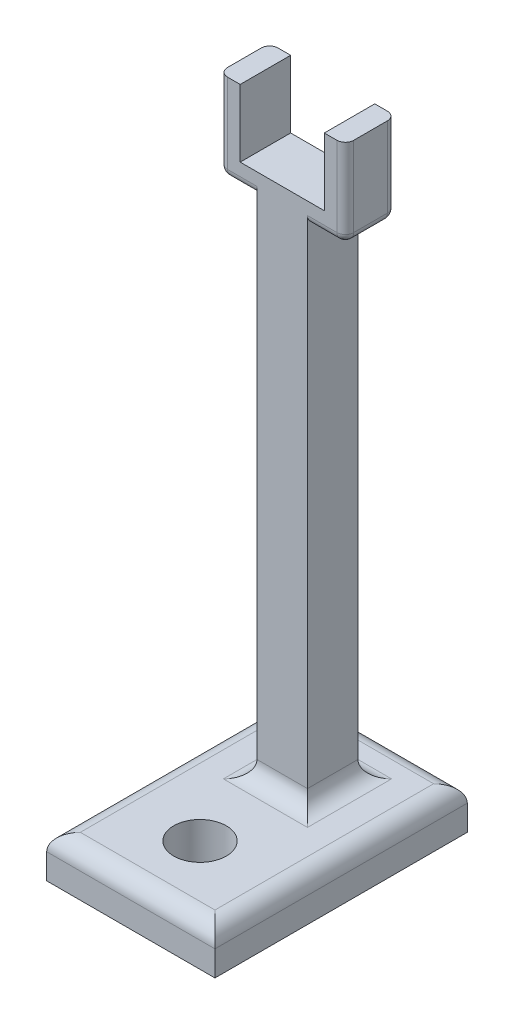
ISO-10303-21;
HEADER;
FILE_DESCRIPTION(('STEP AP214'),'2;1');
FILE_NAME('part.step','',(''),(''),'','','');
FILE_SCHEMA(('AUTOMOTIVE_DESIGN { 1 0 10303 214 1 1 1 1 }'));
ENDSEC;
DATA;
#1=APPLICATION_CONTEXT('core data for automotive mechanical design processes');
#2=APPLICATION_PROTOCOL_DEFINITION('international standard','automotive_design',2000,#1);
#3=PRODUCT_CONTEXT('',#1,'mechanical');
#4=PRODUCT('Part','Part','',(#3));
#5=PRODUCT_RELATED_PRODUCT_CATEGORY('part','',(#4));
#6=PRODUCT_DEFINITION_FORMATION('','',#4);
#7=PRODUCT_DEFINITION_CONTEXT('part definition',#1,'design');
#8=PRODUCT_DEFINITION('design','',#6,#7);
#9=PRODUCT_DEFINITION_SHAPE('','',#8);
#10=(LENGTH_UNIT() NAMED_UNIT(*) SI_UNIT(.MILLI.,.METRE.));
#11=(NAMED_UNIT(*) PLANE_ANGLE_UNIT() SI_UNIT($,.RADIAN.));
#12=(NAMED_UNIT(*) SI_UNIT($,.STERADIAN.) SOLID_ANGLE_UNIT());
#13=UNCERTAINTY_MEASURE_WITH_UNIT(LENGTH_MEASURE(1.E-05),#10,'distance_accuracy_value','');
#14=(GEOMETRIC_REPRESENTATION_CONTEXT(3) GLOBAL_UNCERTAINTY_ASSIGNED_CONTEXT((#13)) GLOBAL_UNIT_ASSIGNED_CONTEXT((#10,
#11,#12)) REPRESENTATION_CONTEXT('',''));
#15=CARTESIAN_POINT('',(0.,0.,0.));
#16=DIRECTION('',(0.,0.,1.));
#17=DIRECTION('',(1.,0.,0.));
#18=AXIS2_PLACEMENT_3D('',#15,#16,#17);
#19=CARTESIAN_POINT('',(0.,6.35,0.));
#20=DIRECTION('',(0.,-1.,0.));
#21=DIRECTION('',(0.,0.,-1.));
#22=AXIS2_PLACEMENT_3D('',#19,#20,#21);
#23=PLANE('',#22);
#24=CARTESIAN_POINT('',(12.7,6.35,-10.4462362128451));
#25=DIRECTION('',(0.,1.,0.));
#26=DIRECTION('',(0.,0.,1.));
#27=AXIS2_PLACEMENT_3D('',#24,#25,#26);
#28=CIRCLE('',#27,3.96875);
#29=CARTESIAN_POINT('',(12.7,6.35,-6.47748621284513));
#30=VERTEX_POINT('',#29);
#31=EDGE_CURVE('E438',#30,#30,#28,.T.);
#32=ORIENTED_EDGE('',*,*,#31,.F.);
#33=EDGE_LOOP('',(#32));
#34=FACE_BOUND('',#33,.T.);
#35=DIRECTION('',(1.,0.,0.));
#36=VECTOR('',#35,1.);
#37=CARTESIAN_POINT('',(8.89,6.35,-20.32));
#38=LINE('',#37,#36);
#39=CARTESIAN_POINT('',(19.05,6.35,-20.32));
#40=VERTEX_POINT('',#39);
#41=CARTESIAN_POINT('',(6.35,6.35,-20.32));
#42=VERTEX_POINT('',#41);
#43=EDGE_CURVE('E374',#40,#42,#38,.F.);
#44=ORIENTED_EDGE('',*,*,#43,.T.);
#45=DIRECTION('',(0.,0.,1.));
#46=VECTOR('',#45,1.);
#47=CARTESIAN_POINT('',(6.35,6.35,-30.48));
#48=LINE('',#47,#46);
#49=CARTESIAN_POINT('',(6.35,6.35,-33.02));
#50=VERTEX_POINT('',#49);
#51=EDGE_CURVE('E380',#42,#50,#48,.F.);
#52=ORIENTED_EDGE('',*,*,#51,.T.);
#53=DIRECTION('',(-1.,0.,0.));
#54=VECTOR('',#53,1.);
#55=CARTESIAN_POINT('',(16.51,6.35,-33.02));
#56=LINE('',#55,#54);
#57=CARTESIAN_POINT('',(19.05,6.35,-33.02));
#58=VERTEX_POINT('',#57);
#59=EDGE_CURVE('E377',#50,#58,#56,.F.);
#60=ORIENTED_EDGE('',*,*,#59,.T.);
#61=DIRECTION('',(0.,0.,-1.));
#62=VECTOR('',#61,1.);
#63=CARTESIAN_POINT('',(19.05,6.35,-22.86));
#64=LINE('',#63,#62);
#65=EDGE_CURVE('E371',#58,#40,#64,.F.);
#66=ORIENTED_EDGE('',*,*,#65,.T.);
#67=EDGE_LOOP('',(#44,#52,#60,#66));
#68=FACE_BOUND('',#67,.T.);
#69=DIRECTION('',(0.,0.,-1.));
#70=VECTOR('',#69,1.);
#71=CARTESIAN_POINT('',(22.86,6.35,0.));
#72=LINE('',#71,#70);
#73=CARTESIAN_POINT('',(22.86,6.35,-2.54));
#74=VERTEX_POINT('',#73);
#75=CARTESIAN_POINT('',(22.86,6.35,-35.56));
#76=VERTEX_POINT('',#75);
#77=EDGE_CURVE('E358',#74,#76,#72,.T.);
#78=ORIENTED_EDGE('',*,*,#77,.T.);
#79=DIRECTION('',(-1.,0.,0.));
#80=VECTOR('',#79,1.);
#81=CARTESIAN_POINT('',(0.,6.35,-35.56));
#82=LINE('',#81,#80);
#83=CARTESIAN_POINT('',(2.54,6.35,-35.56));
#84=VERTEX_POINT('',#83);
#85=EDGE_CURVE('E367',#76,#84,#82,.T.);
#86=ORIENTED_EDGE('',*,*,#85,.T.);
#87=DIRECTION('',(0.,0.,1.));
#88=VECTOR('',#87,1.);
#89=CARTESIAN_POINT('',(2.54,6.35,0.));
#90=LINE('',#89,#88);
#91=CARTESIAN_POINT('',(2.54,6.35,-2.54));
#92=VERTEX_POINT('',#91);
#93=EDGE_CURVE('E364',#84,#92,#90,.T.);
#94=ORIENTED_EDGE('',*,*,#93,.T.);
#95=DIRECTION('',(1.,0.,0.));
#96=VECTOR('',#95,1.);
#97=CARTESIAN_POINT('',(0.,6.35,-2.54));
#98=LINE('',#97,#96);
#99=EDGE_CURVE('E361',#92,#74,#98,.T.);
#100=ORIENTED_EDGE('',*,*,#99,.T.);
#101=EDGE_LOOP('',(#78,#86,#94,#100));
#102=FACE_BOUND('',#101,.T.);
#103=ADVANCED_FACE('F39',(#34,#68,#102),#23,.F.);
#104=CARTESIAN_POINT('',(0.,6.35,0.));
#105=DIRECTION('',(1.,0.,0.));
#106=DIRECTION('',(0.,0.,-1.));
#107=AXIS2_PLACEMENT_3D('',#104,#105,#106);
#108=PLANE('',#107);
#109=DIRECTION('',(0.,-1.,0.));
#110=VECTOR('',#109,1.);
#111=CARTESIAN_POINT('',(0.,6.35,0.));
#112=LINE('',#111,#110);
#113=CARTESIAN_POINT('',(0.,3.81,0.));
#114=VERTEX_POINT('',#113);
#115=CARTESIAN_POINT('',(0.,0.,0.));
#116=VERTEX_POINT('',#115);
#117=EDGE_CURVE('E351',#114,#116,#112,.T.);
#118=ORIENTED_EDGE('',*,*,#117,.F.);
#119=DIRECTION('',(0.,0.,1.));
#120=VECTOR('',#119,1.);
#121=CARTESIAN_POINT('',(0.,3.81,0.));
#122=LINE('',#121,#120);
#123=CARTESIAN_POINT('',(0.,3.81,-38.1));
#124=VERTEX_POINT('',#123);
#125=EDGE_CURVE('E397',#114,#124,#122,.F.);
#126=ORIENTED_EDGE('',*,*,#125,.T.);
#127=DIRECTION('',(0.,-1.,0.));
#128=VECTOR('',#127,1.);
#129=CARTESIAN_POINT('',(0.,6.35,-38.1));
#130=LINE('',#129,#128);
#131=CARTESIAN_POINT('',(0.,0.,-38.1));
#132=VERTEX_POINT('',#131);
#133=EDGE_CURVE('E342',#124,#132,#130,.T.);
#134=ORIENTED_EDGE('',*,*,#133,.T.);
#135=DIRECTION('',(0.,0.,1.));
#136=VECTOR('',#135,1.);
#137=CARTESIAN_POINT('',(0.,0.,0.));
#138=LINE('',#137,#136);
#139=EDGE_CURVE('E326',#132,#116,#138,.T.);
#140=ORIENTED_EDGE('',*,*,#139,.T.);
#141=EDGE_LOOP('',(#118,#126,#134,#140));
#142=FACE_BOUND('',#141,.T.);
#143=ADVANCED_FACE('F662',(#142),#108,.F.);
#144=CARTESIAN_POINT('',(0.,6.35,0.));
#145=DIRECTION('',(0.,0.,-1.));
#146=DIRECTION('',(-1.,0.,0.));
#147=AXIS2_PLACEMENT_3D('',#144,#145,#146);
#148=PLANE('',#147);
#149=DIRECTION('',(0.,-1.,0.));
#150=VECTOR('',#149,1.);
#151=CARTESIAN_POINT('',(25.4,6.35,0.));
#152=LINE('',#151,#150);
#153=CARTESIAN_POINT('',(25.4,3.81,0.));
#154=VERTEX_POINT('',#153);
#155=CARTESIAN_POINT('',(25.4,0.,0.));
#156=VERTEX_POINT('',#155);
#157=EDGE_CURVE('E348',#154,#156,#152,.T.);
#158=ORIENTED_EDGE('',*,*,#157,.F.);
#159=DIRECTION('',(1.,0.,0.));
#160=VECTOR('',#159,1.);
#161=CARTESIAN_POINT('',(0.,3.81,0.));
#162=LINE('',#161,#160);
#163=EDGE_CURVE('E400',#154,#114,#162,.F.);
#164=ORIENTED_EDGE('',*,*,#163,.T.);
#165=ORIENTED_EDGE('',*,*,#117,.T.);
#166=DIRECTION('',(1.,0.,0.));
#167=VECTOR('',#166,1.);
#168=CARTESIAN_POINT('',(0.,0.,0.));
#169=LINE('',#168,#167);
#170=EDGE_CURVE('E330',#116,#156,#169,.T.);
#171=ORIENTED_EDGE('',*,*,#170,.T.);
#172=EDGE_LOOP('',(#158,#164,#165,#171));
#173=FACE_BOUND('',#172,.T.);
#174=ADVANCED_FACE('F668',(#173),#148,.F.);
#175=CARTESIAN_POINT('',(25.4,6.35,0.));
#176=DIRECTION('',(-1.,0.,0.));
#177=DIRECTION('',(0.,0.,1.));
#178=AXIS2_PLACEMENT_3D('',#175,#176,#177);
#179=PLANE('',#178);
#180=DIRECTION('',(0.,-1.,0.));
#181=VECTOR('',#180,1.);
#182=CARTESIAN_POINT('',(25.4,6.35,-38.1));
#183=LINE('',#182,#181);
#184=CARTESIAN_POINT('',(25.4,3.81,-38.1));
#185=VERTEX_POINT('',#184);
#186=CARTESIAN_POINT('',(25.4,0.,-38.1));
#187=VERTEX_POINT('',#186);
#188=EDGE_CURVE('E345',#185,#187,#183,.T.);
#189=ORIENTED_EDGE('',*,*,#188,.F.);
#190=DIRECTION('',(0.,0.,-1.));
#191=VECTOR('',#190,1.);
#192=CARTESIAN_POINT('',(25.4,3.81,0.));
#193=LINE('',#192,#191);
#194=EDGE_CURVE('E403',#185,#154,#193,.F.);
#195=ORIENTED_EDGE('',*,*,#194,.T.);
#196=ORIENTED_EDGE('',*,*,#157,.T.);
#197=DIRECTION('',(0.,0.,-1.));
#198=VECTOR('',#197,1.);
#199=CARTESIAN_POINT('',(25.4,0.,0.));
#200=LINE('',#199,#198);
#201=EDGE_CURVE('E334',#156,#187,#200,.T.);
#202=ORIENTED_EDGE('',*,*,#201,.T.);
#203=EDGE_LOOP('',(#189,#195,#196,#202));
#204=FACE_BOUND('',#203,.T.);
#205=ADVANCED_FACE('F683',(#204),#179,.F.);
#206=CARTESIAN_POINT('',(0.,6.35,-38.1));
#207=DIRECTION('',(0.,0.,1.));
#208=DIRECTION('',(1.,0.,0.));
#209=AXIS2_PLACEMENT_3D('',#206,#207,#208);
#210=PLANE('',#209);
#211=ORIENTED_EDGE('',*,*,#133,.F.);
#212=DIRECTION('',(-1.,0.,0.));
#213=VECTOR('',#212,1.);
#214=CARTESIAN_POINT('',(0.,3.81,-38.1));
#215=LINE('',#214,#213);
#216=EDGE_CURVE('E393',#124,#185,#215,.F.);
#217=ORIENTED_EDGE('',*,*,#216,.T.);
#218=ORIENTED_EDGE('',*,*,#188,.T.);
#219=DIRECTION('',(-1.,0.,0.));
#220=VECTOR('',#219,1.);
#221=CARTESIAN_POINT('',(0.,0.,-38.1));
#222=LINE('',#221,#220);
#223=EDGE_CURVE('E338',#187,#132,#222,.T.);
#224=ORIENTED_EDGE('',*,*,#223,.T.);
#225=EDGE_LOOP('',(#211,#217,#218,#224));
#226=FACE_BOUND('',#225,.T.);
#227=ADVANCED_FACE('F679',(#226),#210,.F.);
#228=CARTESIAN_POINT('',(0.,0.,0.));
#229=DIRECTION('',(0.,-1.,0.));
#230=DIRECTION('',(0.,0.,-1.));
#231=AXIS2_PLACEMENT_3D('',#228,#229,#230);
#232=PLANE('',#231);
#233=CARTESIAN_POINT('',(12.7,0.,-10.4462362128451));
#234=DIRECTION('',(0.,-1.,0.));
#235=DIRECTION('',(0.,0.,-1.));
#236=AXIS2_PLACEMENT_3D('',#233,#234,#235);
#237=CIRCLE('',#236,3.96875);
#238=CARTESIAN_POINT('',(12.7,0.,-14.4149862128451));
#239=VERTEX_POINT('',#238);
#240=EDGE_CURVE('E425',#239,#239,#237,.T.);
#241=ORIENTED_EDGE('',*,*,#240,.F.);
#242=EDGE_LOOP('',(#241));
#243=FACE_BOUND('',#242,.T.);
#244=ORIENTED_EDGE('',*,*,#139,.F.);
#245=ORIENTED_EDGE('',*,*,#223,.F.);
#246=ORIENTED_EDGE('',*,*,#201,.F.);
#247=ORIENTED_EDGE('',*,*,#170,.F.);
#248=EDGE_LOOP('',(#244,#245,#246,#247));
#249=FACE_BOUND('',#248,.T.);
#250=ADVANCED_FACE('F676',(#243,#249),#232,.T.);
#251=CARTESIAN_POINT('',(8.89,82.55,-22.86));
#252=DIRECTION('',(1.,0.,0.));
#253=DIRECTION('',(0.,0.,-1.));
#254=AXIS2_PLACEMENT_3D('',#251,#252,#253);
#255=PLANE('',#254);
#256=DIRECTION('',(0.,-1.,0.));
#257=VECTOR('',#256,1.);
#258=CARTESIAN_POINT('',(8.89,82.55,-30.48));
#259=LINE('',#258,#257);
#260=CARTESIAN_POINT('',(8.89,83.82,-30.48));
#261=VERTEX_POINT('',#260);
#262=CARTESIAN_POINT('',(8.89,8.89000000000002,-30.48));
#263=VERTEX_POINT('',#262);
#264=EDGE_CURVE('E310',#261,#263,#259,.T.);
#265=ORIENTED_EDGE('',*,*,#264,.T.);
#266=DIRECTION('',(0.,0.,1.));
#267=VECTOR('',#266,1.);
#268=CARTESIAN_POINT('',(8.89,8.89,-22.86));
#269=LINE('',#268,#267);
#270=CARTESIAN_POINT('',(8.89,8.89000000000002,-22.86));
#271=VERTEX_POINT('',#270);
#272=EDGE_CURVE('E354',#263,#271,#269,.T.);
#273=ORIENTED_EDGE('',*,*,#272,.T.);
#274=DIRECTION('',(0.,-1.,0.));
#275=VECTOR('',#274,1.);
#276=CARTESIAN_POINT('',(8.89,82.55,-22.86));
#277=LINE('',#276,#275);
#278=CARTESIAN_POINT('',(8.89,83.82,-22.86));
#279=VERTEX_POINT('',#278);
#280=EDGE_CURVE('E322',#279,#271,#277,.T.);
#281=ORIENTED_EDGE('',*,*,#280,.F.);
#282=CARTESIAN_POINT('',(8.89,83.82,-24.13));
#283=DIRECTION('',(1.,0.,0.));
#284=DIRECTION('',(0.,0.,-1.));
#285=AXIS2_PLACEMENT_3D('',#282,#283,#284);
#286=CIRCLE('',#285,1.27);
#287=CARTESIAN_POINT('',(8.89,82.55,-24.13));
#288=VERTEX_POINT('',#287);
#289=EDGE_CURVE('E49',#279,#288,#286,.T.);
#290=ORIENTED_EDGE('',*,*,#289,.T.);
#291=DIRECTION('',(0.,0.,1.));
#292=VECTOR('',#291,1.);
#293=CARTESIAN_POINT('',(8.89,82.55,-22.86));
#294=LINE('',#293,#292);
#295=CARTESIAN_POINT('',(8.89,82.55,-29.21));
#296=VERTEX_POINT('',#295);
#297=EDGE_CURVE('E292',#296,#288,#294,.T.);
#298=ORIENTED_EDGE('',*,*,#297,.F.);
#299=CARTESIAN_POINT('',(8.89,83.82,-29.21));
#300=DIRECTION('',(1.,0.,0.));
#301=DIRECTION('',(0.,0.,-1.));
#302=AXIS2_PLACEMENT_3D('',#299,#300,#301);
#303=CIRCLE('',#302,1.27);
#304=EDGE_CURVE('E511',#296,#261,#303,.T.);
#305=ORIENTED_EDGE('',*,*,#304,.T.);
#306=EDGE_LOOP('',(#265,#273,#281,#290,#298,#305));
#307=FACE_BOUND('',#306,.T.);
#308=ADVANCED_FACE('F603',(#307),#255,.F.);
#309=CARTESIAN_POINT('',(8.89,82.55,-22.86));
#310=DIRECTION('',(0.,0.,-1.));
#311=DIRECTION('',(-1.,0.,0.));
#312=AXIS2_PLACEMENT_3D('',#309,#310,#311);
#313=PLANE('',#312);
#314=DIRECTION('',(1.,0.,0.));
#315=VECTOR('',#314,1.);
#316=CARTESIAN_POINT('',(8.89,83.82,-22.86));
#317=LINE('',#316,#315);
#318=CARTESIAN_POINT('',(4.44499999999999,83.82,-22.86));
#319=VERTEX_POINT('',#318);
#320=EDGE_CURVE('E495',#319,#279,#317,.T.);
#321=ORIENTED_EDGE('',*,*,#320,.T.);
#322=ORIENTED_EDGE('',*,*,#280,.T.);
#323=DIRECTION('',(1.,0.,0.));
#324=VECTOR('',#323,1.);
#325=CARTESIAN_POINT('',(16.51,8.89,-22.86));
#326=LINE('',#325,#324);
#327=CARTESIAN_POINT('',(16.51,8.89000000000002,-22.86));
#328=VERTEX_POINT('',#327);
#329=EDGE_CURVE('E387',#271,#328,#326,.T.);
#330=ORIENTED_EDGE('',*,*,#329,.T.);
#331=DIRECTION('',(0.,-1.,0.));
#332=VECTOR('',#331,1.);
#333=CARTESIAN_POINT('',(16.51,82.55,-22.86));
#334=LINE('',#333,#332);
#335=CARTESIAN_POINT('',(16.51,83.82,-22.86));
#336=VERTEX_POINT('',#335);
#337=EDGE_CURVE('E318',#336,#328,#334,.T.);
#338=ORIENTED_EDGE('',*,*,#337,.F.);
#339=DIRECTION('',(1.,0.,0.));
#340=VECTOR('',#339,1.);
#341=CARTESIAN_POINT('',(22.225,83.82,-22.86));
#342=LINE('',#341,#340);
#343=CARTESIAN_POINT('',(20.955,83.82,-22.86));
#344=VERTEX_POINT('',#343);
#345=EDGE_CURVE('E489',#336,#344,#342,.T.);
#346=ORIENTED_EDGE('',*,*,#345,.T.);
#347=DIRECTION('',(0.,1.,0.));
#348=VECTOR('',#347,1.);
#349=CARTESIAN_POINT('',(20.955,95.885,-22.86));
#350=LINE('',#349,#348);
#351=CARTESIAN_POINT('',(20.955,95.885,-22.86));
#352=VERTEX_POINT('',#351);
#353=EDGE_CURVE('E486',#344,#352,#350,.T.);
#354=ORIENTED_EDGE('',*,*,#353,.T.);
#355=DIRECTION('',(-1.,0.,0.));
#356=VECTOR('',#355,1.);
#357=CARTESIAN_POINT('',(19.05,95.885,-22.86));
#358=LINE('',#357,#356);
#359=CARTESIAN_POINT('',(19.05,95.885,-22.86));
#360=VERTEX_POINT('',#359);
#361=EDGE_CURVE('E271',#352,#360,#358,.T.);
#362=ORIENTED_EDGE('',*,*,#361,.T.);
#363=DIRECTION('',(0.,-1.,0.));
#364=VECTOR('',#363,1.);
#365=CARTESIAN_POINT('',(19.05,95.885,-22.86));
#366=LINE('',#365,#364);
#367=CARTESIAN_POINT('',(19.05,85.725,-22.86));
#368=VERTEX_POINT('',#367);
#369=EDGE_CURVE('E247',#360,#368,#366,.T.);
#370=ORIENTED_EDGE('',*,*,#369,.T.);
#371=DIRECTION('',(-1.,0.,0.));
#372=VECTOR('',#371,1.);
#373=CARTESIAN_POINT('',(6.34999999999999,85.725,-22.86));
#374=LINE('',#373,#372);
#375=CARTESIAN_POINT('',(6.34999999999999,85.725,-22.86));
#376=VERTEX_POINT('',#375);
#377=EDGE_CURVE('E277',#368,#376,#374,.T.);
#378=ORIENTED_EDGE('',*,*,#377,.T.);
#379=DIRECTION('',(0.,1.,0.));
#380=VECTOR('',#379,1.);
#381=CARTESIAN_POINT('',(6.34999999999999,95.885,-22.86));
#382=LINE('',#381,#380);
#383=CARTESIAN_POINT('',(6.34999999999999,95.885,-22.86));
#384=VERTEX_POINT('',#383);
#385=EDGE_CURVE('E281',#376,#384,#382,.T.);
#386=ORIENTED_EDGE('',*,*,#385,.T.);
#387=DIRECTION('',(-1.,0.,0.));
#388=VECTOR('',#387,1.);
#389=CARTESIAN_POINT('',(3.17499999999999,95.885,-22.86));
#390=LINE('',#389,#388);
#391=CARTESIAN_POINT('',(4.44499999999999,95.885,-22.86));
#392=VERTEX_POINT('',#391);
#393=EDGE_CURVE('E241',#384,#392,#390,.T.);
#394=ORIENTED_EDGE('',*,*,#393,.T.);
#395=DIRECTION('',(0.,-1.,0.));
#396=VECTOR('',#395,1.);
#397=CARTESIAN_POINT('',(4.44499999999999,82.55,-22.86));
#398=LINE('',#397,#396);
#399=EDGE_CURVE('E492',#392,#319,#398,.T.);
#400=ORIENTED_EDGE('',*,*,#399,.T.);
#401=EDGE_LOOP('',(#321,#322,#330,#338,#346,#354,#362,#370,#378,#386,#394,#400));
#402=FACE_BOUND('',#401,.T.);
#403=ADVANCED_FACE('F605',(#402),#313,.F.);
#404=CARTESIAN_POINT('',(16.51,82.55,-22.86));
#405=DIRECTION('',(-1.,0.,0.));
#406=DIRECTION('',(0.,0.,1.));
#407=AXIS2_PLACEMENT_3D('',#404,#405,#406);
#408=PLANE('',#407);
#409=ORIENTED_EDGE('',*,*,#337,.T.);
#410=DIRECTION('',(0.,0.,-1.));
#411=VECTOR('',#410,1.);
#412=CARTESIAN_POINT('',(16.51,8.89,-30.48));
#413=LINE('',#412,#411);
#414=CARTESIAN_POINT('',(16.51,8.89000000000002,-30.48));
#415=VERTEX_POINT('',#414);
#416=EDGE_CURVE('E390',#328,#415,#413,.T.);
#417=ORIENTED_EDGE('',*,*,#416,.T.);
#418=DIRECTION('',(0.,-1.,0.));
#419=VECTOR('',#418,1.);
#420=CARTESIAN_POINT('',(16.51,82.55,-30.48));
#421=LINE('',#420,#419);
#422=CARTESIAN_POINT('',(16.51,83.82,-30.48));
#423=VERTEX_POINT('',#422);
#424=EDGE_CURVE('E314',#423,#415,#421,.T.);
#425=ORIENTED_EDGE('',*,*,#424,.F.);
#426=CARTESIAN_POINT('',(16.51,83.82,-29.21));
#427=DIRECTION('',(-1.,0.,0.));
#428=DIRECTION('',(0.,0.,1.));
#429=AXIS2_PLACEMENT_3D('',#426,#427,#428);
#430=CIRCLE('',#429,1.27);
#431=CARTESIAN_POINT('',(16.51,82.55,-29.21));
#432=VERTEX_POINT('',#431);
#433=EDGE_CURVE('E515',#423,#432,#430,.T.);
#434=ORIENTED_EDGE('',*,*,#433,.T.);
#435=DIRECTION('',(0.,0.,-1.));
#436=VECTOR('',#435,1.);
#437=CARTESIAN_POINT('',(16.51,82.55,-22.86));
#438=LINE('',#437,#436);
#439=CARTESIAN_POINT('',(16.51,82.55,-24.13));
#440=VERTEX_POINT('',#439);
#441=EDGE_CURVE('E306',#440,#432,#438,.T.);
#442=ORIENTED_EDGE('',*,*,#441,.F.);
#443=CARTESIAN_POINT('',(16.51,83.82,-24.13));
#444=DIRECTION('',(-1.,0.,0.));
#445=DIRECTION('',(0.,0.,1.));
#446=AXIS2_PLACEMENT_3D('',#443,#444,#445);
#447=CIRCLE('',#446,1.27);
#448=EDGE_CURVE('E11',#440,#336,#447,.T.);
#449=ORIENTED_EDGE('',*,*,#448,.T.);
#450=EDGE_LOOP('',(#409,#417,#425,#434,#442,#449));
#451=FACE_BOUND('',#450,.T.);
#452=ADVANCED_FACE('F941',(#451),#408,.F.);
#453=CARTESIAN_POINT('',(8.89,82.55,-30.48));
#454=DIRECTION('',(0.,0.,1.));
#455=DIRECTION('',(1.,0.,0.));
#456=AXIS2_PLACEMENT_3D('',#453,#454,#455);
#457=PLANE('',#456);
#458=DIRECTION('',(1.,0.,0.));
#459=VECTOR('',#458,1.);
#460=CARTESIAN_POINT('',(3.17499999999999,83.82,-30.48));
#461=LINE('',#460,#459);
#462=CARTESIAN_POINT('',(4.44499999999999,83.82,-30.48));
#463=VERTEX_POINT('',#462);
#464=EDGE_CURVE('E464',#261,#463,#461,.F.);
#465=ORIENTED_EDGE('',*,*,#464,.T.);
#466=DIRECTION('',(0.,-1.,0.));
#467=VECTOR('',#466,1.);
#468=CARTESIAN_POINT('',(4.44499999999999,95.885,-30.48));
#469=LINE('',#468,#467);
#470=CARTESIAN_POINT('',(4.44499999999999,95.885,-30.48));
#471=VERTEX_POINT('',#470);
#472=EDGE_CURVE('E467',#463,#471,#469,.F.);
#473=ORIENTED_EDGE('',*,*,#472,.T.);
#474=DIRECTION('',(-1.,0.,0.));
#475=VECTOR('',#474,1.);
#476=CARTESIAN_POINT('',(3.17499999999999,95.885,-30.48));
#477=LINE('',#476,#475);
#478=CARTESIAN_POINT('',(6.34999999999999,95.885,-30.48));
#479=VERTEX_POINT('',#478);
#480=EDGE_CURVE('E267',#479,#471,#477,.T.);
#481=ORIENTED_EDGE('',*,*,#480,.F.);
#482=DIRECTION('',(0.,1.,0.));
#483=VECTOR('',#482,1.);
#484=CARTESIAN_POINT('',(6.34999999999999,95.885,-30.48));
#485=LINE('',#484,#483);
#486=CARTESIAN_POINT('',(6.34999999999999,85.725,-30.48));
#487=VERTEX_POINT('',#486);
#488=EDGE_CURVE('E260',#487,#479,#485,.T.);
#489=ORIENTED_EDGE('',*,*,#488,.F.);
#490=DIRECTION('',(-1.,0.,0.));
#491=VECTOR('',#490,1.);
#492=CARTESIAN_POINT('',(6.34999999999999,85.725,-30.48));
#493=LINE('',#492,#491);
#494=CARTESIAN_POINT('',(19.05,85.725,-30.48));
#495=VERTEX_POINT('',#494);
#496=EDGE_CURVE('E256',#495,#487,#493,.T.);
#497=ORIENTED_EDGE('',*,*,#496,.F.);
#498=DIRECTION('',(0.,-1.,0.));
#499=VECTOR('',#498,1.);
#500=CARTESIAN_POINT('',(19.05,95.885,-30.48));
#501=LINE('',#500,#499);
#502=CARTESIAN_POINT('',(19.05,95.885,-30.48));
#503=VERTEX_POINT('',#502);
#504=EDGE_CURVE('E240',#503,#495,#501,.T.);
#505=ORIENTED_EDGE('',*,*,#504,.F.);
#506=DIRECTION('',(-1.,0.,0.));
#507=VECTOR('',#506,1.);
#508=CARTESIAN_POINT('',(19.05,95.885,-30.48));
#509=LINE('',#508,#507);
#510=CARTESIAN_POINT('',(20.955,95.885,-30.48));
#511=VERTEX_POINT('',#510);
#512=EDGE_CURVE('E227',#511,#503,#509,.T.);
#513=ORIENTED_EDGE('',*,*,#512,.F.);
#514=DIRECTION('',(0.,1.,0.));
#515=VECTOR('',#514,1.);
#516=CARTESIAN_POINT('',(20.955,82.55,-30.48));
#517=LINE('',#516,#515);
#518=CARTESIAN_POINT('',(20.955,83.82,-30.48));
#519=VERTEX_POINT('',#518);
#520=EDGE_CURVE('E457',#511,#519,#517,.F.);
#521=ORIENTED_EDGE('',*,*,#520,.T.);
#522=DIRECTION('',(1.,0.,0.));
#523=VECTOR('',#522,1.);
#524=CARTESIAN_POINT('',(16.51,83.82,-30.48));
#525=LINE('',#524,#523);
#526=EDGE_CURVE('E460',#519,#423,#525,.F.);
#527=ORIENTED_EDGE('',*,*,#526,.T.);
#528=ORIENTED_EDGE('',*,*,#424,.T.);
#529=DIRECTION('',(-1.,0.,0.));
#530=VECTOR('',#529,1.);
#531=CARTESIAN_POINT('',(8.89,8.89,-30.48));
#532=LINE('',#531,#530);
#533=EDGE_CURVE('E384',#415,#263,#532,.T.);
#534=ORIENTED_EDGE('',*,*,#533,.T.);
#535=ORIENTED_EDGE('',*,*,#264,.F.);
#536=EDGE_LOOP('',(#465,#473,#481,#489,#497,#505,#513,#521,#527,#528,#534,#535));
#537=FACE_BOUND('',#536,.T.);
#538=ADVANCED_FACE('F253',(#537),#457,.F.);
#539=CARTESIAN_POINT('',(3.17499999999999,82.55,-30.48));
#540=DIRECTION('',(0.,-1.,0.));
#541=DIRECTION('',(0.,0.,-1.));
#542=AXIS2_PLACEMENT_3D('',#539,#540,#541);
#543=PLANE('',#542);
#544=DIRECTION('',(0.,0.,1.));
#545=VECTOR('',#544,1.);
#546=CARTESIAN_POINT('',(4.44499999999999,82.55,-30.48));
#547=LINE('',#546,#545);
#548=CARTESIAN_POINT('',(4.44499999999999,82.55,-24.13));
#549=VERTEX_POINT('',#548);
#550=CARTESIAN_POINT('',(4.44499999999999,82.55,-29.21));
#551=VERTEX_POINT('',#550);
#552=EDGE_CURVE('E451',#549,#551,#547,.F.);
#553=ORIENTED_EDGE('',*,*,#552,.T.);
#554=DIRECTION('',(1.,0.,0.));
#555=VECTOR('',#554,1.);
#556=CARTESIAN_POINT('',(8.89,82.55,-29.21));
#557=LINE('',#556,#555);
#558=EDGE_CURVE('E454',#551,#296,#557,.T.);
#559=ORIENTED_EDGE('',*,*,#558,.T.);
#560=ORIENTED_EDGE('',*,*,#297,.T.);
#561=DIRECTION('',(1.,0.,0.));
#562=VECTOR('',#561,1.);
#563=CARTESIAN_POINT('',(3.17499999999999,82.55,-24.13));
#564=LINE('',#563,#562);
#565=EDGE_CURVE('E448',#288,#549,#564,.F.);
#566=ORIENTED_EDGE('',*,*,#565,.T.);
#567=EDGE_LOOP('',(#553,#559,#560,#566));
#568=FACE_BOUND('',#567,.T.);
#569=ADVANCED_FACE('F617',(#568),#543,.T.);
#570=CARTESIAN_POINT('',(3.17499999999999,82.55,-30.48));
#571=DIRECTION('',(-1.,0.,0.));
#572=DIRECTION('',(0.,0.,1.));
#573=AXIS2_PLACEMENT_3D('',#570,#571,#572);
#574=PLANE('',#573);
#575=DIRECTION('',(0.,0.,1.));
#576=VECTOR('',#575,1.);
#577=CARTESIAN_POINT('',(3.17499999999999,95.885,-30.48));
#578=LINE('',#577,#576);
#579=CARTESIAN_POINT('',(3.17499999999999,95.885,-29.21));
#580=VERTEX_POINT('',#579);
#581=CARTESIAN_POINT('',(3.17499999999999,95.885,-24.13));
#582=VERTEX_POINT('',#581);
#583=EDGE_CURVE('E288',#580,#582,#578,.T.);
#584=ORIENTED_EDGE('',*,*,#583,.F.);
#585=DIRECTION('',(0.,-1.,0.));
#586=VECTOR('',#585,1.);
#587=CARTESIAN_POINT('',(3.17499999999999,82.55,-29.21));
#588=LINE('',#587,#586);
#589=CARTESIAN_POINT('',(3.17499999999999,83.82,-29.21));
#590=VERTEX_POINT('',#589);
#591=EDGE_CURVE('E445',#580,#590,#588,.T.);
#592=ORIENTED_EDGE('',*,*,#591,.T.);
#593=DIRECTION('',(0.,0.,1.));
#594=VECTOR('',#593,1.);
#595=CARTESIAN_POINT('',(3.17499999999999,83.82,-30.48));
#596=LINE('',#595,#594);
#597=CARTESIAN_POINT('',(3.17499999999999,83.82,-24.13));
#598=VERTEX_POINT('',#597);
#599=EDGE_CURVE('E441',#590,#598,#596,.T.);
#600=ORIENTED_EDGE('',*,*,#599,.T.);
#601=DIRECTION('',(0.,-1.,0.));
#602=VECTOR('',#601,1.);
#603=CARTESIAN_POINT('',(3.17499999999999,95.885,-24.13));
#604=LINE('',#603,#602);
#605=EDGE_CURVE('E406',#598,#582,#604,.F.);
#606=ORIENTED_EDGE('',*,*,#605,.T.);
#607=EDGE_LOOP('',(#584,#592,#600,#606));
#608=FACE_BOUND('',#607,.T.);
#609=ADVANCED_FACE('F634',(#608),#574,.T.);
#610=CARTESIAN_POINT('',(3.17499999999999,95.885,-30.48));
#611=DIRECTION('',(0.,1.,0.));
#612=DIRECTION('',(0.,0.,1.));
#613=AXIS2_PLACEMENT_3D('',#610,#611,#612);
#614=PLANE('',#613);
#615=ORIENTED_EDGE('',*,*,#480,.T.);
#616=CARTESIAN_POINT('',(4.44499999999999,95.885,-29.21));
#617=DIRECTION('',(0.,1.,0.));
#618=DIRECTION('',(0.,0.,1.));
#619=AXIS2_PLACEMENT_3D('',#616,#617,#618);
#620=CIRCLE('',#619,1.27);
#621=EDGE_CURVE('E473',#471,#580,#620,.T.);
#622=ORIENTED_EDGE('',*,*,#621,.T.);
#623=ORIENTED_EDGE('',*,*,#583,.T.);
#624=CARTESIAN_POINT('',(4.44499999999999,95.885,-24.13));
#625=DIRECTION('',(0.,1.,0.));
#626=DIRECTION('',(0.,0.,1.));
#627=AXIS2_PLACEMENT_3D('',#624,#625,#626);
#628=CIRCLE('',#627,1.27);
#629=EDGE_CURVE('E470',#582,#392,#628,.T.);
#630=ORIENTED_EDGE('',*,*,#629,.T.);
#631=ORIENTED_EDGE('',*,*,#393,.F.);
#632=DIRECTION('',(0.,0.,1.));
#633=VECTOR('',#632,1.);
#634=CARTESIAN_POINT('',(6.34999999999999,95.885,-30.48));
#635=LINE('',#634,#633);
#636=EDGE_CURVE('E293',#479,#384,#635,.T.);
#637=ORIENTED_EDGE('',*,*,#636,.F.);
#638=EDGE_LOOP('',(#615,#622,#623,#630,#631,#637));
#639=FACE_BOUND('',#638,.T.);
#640=ADVANCED_FACE('F643',(#639),#614,.T.);
#641=CARTESIAN_POINT('',(6.34999999999999,95.885,-30.48));
#642=DIRECTION('',(1.,0.,0.));
#643=DIRECTION('',(0.,1.,0.));
#644=AXIS2_PLACEMENT_3D('',#641,#642,#643);
#645=PLANE('',#644);
#646=ORIENTED_EDGE('',*,*,#385,.F.);
#647=DIRECTION('',(0.,0.,1.));
#648=VECTOR('',#647,1.);
#649=CARTESIAN_POINT('',(6.34999999999999,85.725,-30.48));
#650=LINE('',#649,#648);
#651=EDGE_CURVE('E296',#487,#376,#650,.T.);
#652=ORIENTED_EDGE('',*,*,#651,.F.);
#653=ORIENTED_EDGE('',*,*,#488,.T.);
#654=ORIENTED_EDGE('',*,*,#636,.T.);
#655=EDGE_LOOP('',(#646,#652,#653,#654));
#656=FACE_BOUND('',#655,.T.);
#657=ADVANCED_FACE('F647',(#656),#645,.T.);
#658=CARTESIAN_POINT('',(6.34999999999999,85.725,-30.48));
#659=DIRECTION('',(0.,1.,0.));
#660=DIRECTION('',(0.,0.,1.));
#661=AXIS2_PLACEMENT_3D('',#658,#659,#660);
#662=PLANE('',#661);
#663=ORIENTED_EDGE('',*,*,#377,.F.);
#664=DIRECTION('',(0.,0.,1.));
#665=VECTOR('',#664,1.);
#666=CARTESIAN_POINT('',(19.05,85.725,-30.48));
#667=LINE('',#666,#665);
#668=EDGE_CURVE('E249',#495,#368,#667,.T.);
#669=ORIENTED_EDGE('',*,*,#668,.F.);
#670=ORIENTED_EDGE('',*,*,#496,.T.);
#671=ORIENTED_EDGE('',*,*,#651,.T.);
#672=EDGE_LOOP('',(#663,#669,#670,#671));
#673=FACE_BOUND('',#672,.T.);
#674=ADVANCED_FACE('F650',(#673),#662,.T.);
#675=CARTESIAN_POINT('',(19.05,95.885,-30.48));
#676=DIRECTION('',(-1.,0.,0.));
#677=DIRECTION('',(0.,-1.,0.));
#678=AXIS2_PLACEMENT_3D('',#675,#676,#677);
#679=PLANE('',#678);
#680=ORIENTED_EDGE('',*,*,#369,.F.);
#681=DIRECTION('',(0.,0.,1.));
#682=VECTOR('',#681,1.);
#683=CARTESIAN_POINT('',(19.05,95.885,-30.48));
#684=LINE('',#683,#682);
#685=EDGE_CURVE('E232',#503,#360,#684,.T.);
#686=ORIENTED_EDGE('',*,*,#685,.F.);
#687=ORIENTED_EDGE('',*,*,#504,.T.);
#688=ORIENTED_EDGE('',*,*,#668,.T.);
#689=EDGE_LOOP('',(#680,#686,#687,#688));
#690=FACE_BOUND('',#689,.T.);
#691=ADVANCED_FACE('F245',(#690),#679,.T.);
#692=CARTESIAN_POINT('',(19.05,95.885,-30.48));
#693=DIRECTION('',(0.,1.,0.));
#694=DIRECTION('',(0.,0.,1.));
#695=AXIS2_PLACEMENT_3D('',#692,#693,#694);
#696=PLANE('',#695);
#697=DIRECTION('',(0.,0.,1.));
#698=VECTOR('',#697,1.);
#699=CARTESIAN_POINT('',(22.225,95.885,-30.48));
#700=LINE('',#699,#698);
#701=CARTESIAN_POINT('',(22.225,95.885,-29.21));
#702=VERTEX_POINT('',#701);
#703=CARTESIAN_POINT('',(22.225,95.885,-24.13));
#704=VERTEX_POINT('',#703);
#705=EDGE_CURVE('E250',#702,#704,#700,.T.);
#706=ORIENTED_EDGE('',*,*,#705,.F.);
#707=CARTESIAN_POINT('',(20.955,95.885,-29.21));
#708=DIRECTION('',(0.,1.,0.));
#709=DIRECTION('',(0.,0.,1.));
#710=AXIS2_PLACEMENT_3D('',#707,#708,#709);
#711=CIRCLE('',#710,1.27);
#712=EDGE_CURVE('E235',#702,#511,#711,.T.);
#713=ORIENTED_EDGE('',*,*,#712,.T.);
#714=ORIENTED_EDGE('',*,*,#512,.T.);
#715=ORIENTED_EDGE('',*,*,#685,.T.);
#716=ORIENTED_EDGE('',*,*,#361,.F.);
#717=CARTESIAN_POINT('',(20.955,95.885,-24.13));
#718=DIRECTION('',(0.,1.,0.));
#719=DIRECTION('',(0.,0.,1.));
#720=AXIS2_PLACEMENT_3D('',#717,#718,#719);
#721=CIRCLE('',#720,1.27);
#722=EDGE_CURVE('E506',#352,#704,#721,.T.);
#723=ORIENTED_EDGE('',*,*,#722,.T.);
#724=EDGE_LOOP('',(#706,#713,#714,#715,#716,#723));
#725=FACE_BOUND('',#724,.T.);
#726=ADVANCED_FACE('F230',(#725),#696,.T.);
#727=CARTESIAN_POINT('',(22.225,82.55,-30.48));
#728=DIRECTION('',(1.,0.,0.));
#729=DIRECTION('',(0.,0.,-1.));
#730=AXIS2_PLACEMENT_3D('',#727,#728,#729);
#731=PLANE('',#730);
#732=DIRECTION('',(0.,0.,1.));
#733=VECTOR('',#732,1.);
#734=CARTESIAN_POINT('',(22.225,83.82,-30.48));
#735=LINE('',#734,#733);
#736=CARTESIAN_POINT('',(22.225,83.82,-24.13));
#737=VERTEX_POINT('',#736);
#738=CARTESIAN_POINT('',(22.225,83.82,-29.21));
#739=VERTEX_POINT('',#738);
#740=EDGE_CURVE('E57',#737,#739,#735,.F.);
#741=ORIENTED_EDGE('',*,*,#740,.T.);
#742=DIRECTION('',(0.,1.,0.));
#743=VECTOR('',#742,1.);
#744=CARTESIAN_POINT('',(22.225,95.885,-29.21));
#745=LINE('',#744,#743);
#746=EDGE_CURVE('E503',#739,#702,#745,.T.);
#747=ORIENTED_EDGE('',*,*,#746,.T.);
#748=ORIENTED_EDGE('',*,*,#705,.T.);
#749=DIRECTION('',(0.,1.,0.));
#750=VECTOR('',#749,1.);
#751=CARTESIAN_POINT('',(22.225,82.55,-24.13));
#752=LINE('',#751,#750);
#753=EDGE_CURVE('E62',#704,#737,#752,.F.);
#754=ORIENTED_EDGE('',*,*,#753,.T.);
#755=EDGE_LOOP('',(#741,#747,#748,#754));
#756=FACE_BOUND('',#755,.T.);
#757=ADVANCED_FACE('F875',(#756),#731,.T.);
#758=ORIENTED_EDGE('',*,*,#441,.T.);
#759=DIRECTION('',(1.,0.,0.));
#760=VECTOR('',#759,1.);
#761=CARTESIAN_POINT('',(22.225,82.55,-29.21));
#762=LINE('',#761,#760);
#763=CARTESIAN_POINT('',(20.955,82.55,-29.21));
#764=VERTEX_POINT('',#763);
#765=EDGE_CURVE('E482',#432,#764,#762,.T.);
#766=ORIENTED_EDGE('',*,*,#765,.T.);
#767=DIRECTION('',(0.,0.,1.));
#768=VECTOR('',#767,1.);
#769=CARTESIAN_POINT('',(20.955,82.55,-30.48));
#770=LINE('',#769,#768);
#771=CARTESIAN_POINT('',(20.955,82.55,-24.13));
#772=VERTEX_POINT('',#771);
#773=EDGE_CURVE('E476',#764,#772,#770,.T.);
#774=ORIENTED_EDGE('',*,*,#773,.T.);
#775=DIRECTION('',(1.,0.,0.));
#776=VECTOR('',#775,1.);
#777=CARTESIAN_POINT('',(16.51,82.55,-24.13));
#778=LINE('',#777,#776);
#779=EDGE_CURVE('E479',#772,#440,#778,.F.);
#780=ORIENTED_EDGE('',*,*,#779,.T.);
#781=EDGE_LOOP('',(#758,#766,#774,#780));
#782=FACE_BOUND('',#781,.T.);
#783=ADVANCED_FACE('F702',(#782),#543,.T.);
#784=CARTESIAN_POINT('',(19.05,8.89,-22.86));
#785=DIRECTION('',(0.,0.,1.));
#786=DIRECTION('',(1.,0.,0.));
#787=AXIS2_PLACEMENT_3D('',#784,#785,#786);
#788=CYLINDRICAL_SURFACE('',#787,2.54);
#789=CARTESIAN_POINT('',(19.05,8.89,-20.32));
#790=DIRECTION('',(-0.707106781186547,0.,0.707106781186547));
#791=DIRECTION('',(0.707106781186547,0.,0.707106781186547));
#792=AXIS2_PLACEMENT_3D('',#789,#790,#791);
#793=ELLIPSE('',#792,3.59210244842766,2.54);
#794=EDGE_CURVE('E414',#40,#328,#793,.F.);
#795=ORIENTED_EDGE('',*,*,#794,.F.);
#796=ORIENTED_EDGE('',*,*,#65,.F.);
#797=CARTESIAN_POINT('',(19.05,8.89,-33.02));
#798=DIRECTION('',(0.707106781186547,0.,0.707106781186547));
#799=DIRECTION('',(-0.707106781186547,0.,0.707106781186547));
#800=AXIS2_PLACEMENT_3D('',#797,#798,#799);
#801=ELLIPSE('',#800,3.59210244842766,2.54);
#802=EDGE_CURVE('E274',#415,#58,#801,.T.);
#803=ORIENTED_EDGE('',*,*,#802,.F.);
#804=ORIENTED_EDGE('',*,*,#416,.F.);
#805=EDGE_LOOP('',(#795,#796,#803,#804));
#806=FACE_BOUND('',#805,.T.);
#807=ADVANCED_FACE('F591',(#806),#788,.F.);
#808=CARTESIAN_POINT('',(8.89,8.89,-33.02));
#809=DIRECTION('',(1.,0.,0.));
#810=DIRECTION('',(0.,0.,-1.));
#811=AXIS2_PLACEMENT_3D('',#808,#809,#810);
#812=CYLINDRICAL_SURFACE('',#811,2.54);
#813=ORIENTED_EDGE('',*,*,#802,.T.);
#814=ORIENTED_EDGE('',*,*,#59,.F.);
#815=CARTESIAN_POINT('',(6.35,8.89,-33.02));
#816=DIRECTION('',(0.707106781186547,0.,-0.707106781186547));
#817=DIRECTION('',(0.707106781186547,0.,0.707106781186547));
#818=AXIS2_PLACEMENT_3D('',#815,#816,#817);
#819=ELLIPSE('',#818,3.59210244842766,2.54);
#820=EDGE_CURVE('E410',#263,#50,#819,.T.);
#821=ORIENTED_EDGE('',*,*,#820,.F.);
#822=ORIENTED_EDGE('',*,*,#533,.F.);
#823=EDGE_LOOP('',(#813,#814,#821,#822));
#824=FACE_BOUND('',#823,.T.);
#825=ADVANCED_FACE('F595',(#824),#812,.F.);
#826=CARTESIAN_POINT('',(8.89,8.89,-20.32));
#827=DIRECTION('',(-1.,0.,0.));
#828=DIRECTION('',(0.,0.,1.));
#829=AXIS2_PLACEMENT_3D('',#826,#827,#828);
#830=CYLINDRICAL_SURFACE('',#829,2.54);
#831=ORIENTED_EDGE('',*,*,#794,.T.);
#832=ORIENTED_EDGE('',*,*,#329,.F.);
#833=CARTESIAN_POINT('',(6.35,8.89,-20.32));
#834=DIRECTION('',(-0.707106781186547,0.,-0.707106781186547));
#835=DIRECTION('',(-0.707106781186547,0.,0.707106781186547));
#836=AXIS2_PLACEMENT_3D('',#833,#834,#835);
#837=ELLIPSE('',#836,3.59210244842766,2.54);
#838=EDGE_CURVE('E407',#42,#271,#837,.F.);
#839=ORIENTED_EDGE('',*,*,#838,.F.);
#840=ORIENTED_EDGE('',*,*,#43,.F.);
#841=EDGE_LOOP('',(#831,#832,#839,#840));
#842=FACE_BOUND('',#841,.T.);
#843=ADVANCED_FACE('F694',(#842),#830,.F.);
#844=CARTESIAN_POINT('',(6.35,8.89,-22.86));
#845=DIRECTION('',(0.,0.,-1.));
#846=DIRECTION('',(-1.,0.,0.));
#847=AXIS2_PLACEMENT_3D('',#844,#845,#846);
#848=CYLINDRICAL_SURFACE('',#847,2.54);
#849=ORIENTED_EDGE('',*,*,#820,.T.);
#850=ORIENTED_EDGE('',*,*,#51,.F.);
#851=ORIENTED_EDGE('',*,*,#838,.T.);
#852=ORIENTED_EDGE('',*,*,#272,.F.);
#853=EDGE_LOOP('',(#849,#850,#851,#852));
#854=FACE_BOUND('',#853,.T.);
#855=ADVANCED_FACE('F599',(#854),#848,.F.);
#856=CARTESIAN_POINT('',(0.,3.81,-2.54));
#857=DIRECTION('',(1.,0.,0.));
#858=DIRECTION('',(0.,0.,-1.));
#859=AXIS2_PLACEMENT_3D('',#856,#857,#858);
#860=CYLINDRICAL_SURFACE('',#859,2.54);
#861=CARTESIAN_POINT('',(2.54,3.81,-2.54));
#862=DIRECTION('',(0.707106781186547,0.,0.707106781186547));
#863=DIRECTION('',(0.707106781186547,0.,-0.707106781186547));
#864=AXIS2_PLACEMENT_3D('',#861,#862,#863);
#865=ELLIPSE('',#864,3.59210244842766,2.54);
#866=EDGE_CURVE('E428',#114,#92,#865,.F.);
#867=ORIENTED_EDGE('',*,*,#866,.F.);
#868=ORIENTED_EDGE('',*,*,#163,.F.);
#869=CARTESIAN_POINT('',(22.86,3.81,-2.54));
#870=DIRECTION('',(0.707106781186547,0.,-0.707106781186547));
#871=DIRECTION('',(-0.707106781186547,0.,-0.707106781186547));
#872=AXIS2_PLACEMENT_3D('',#869,#870,#871);
#873=ELLIPSE('',#872,3.59210244842766,2.54);
#874=EDGE_CURVE('E411',#74,#154,#873,.T.);
#875=ORIENTED_EDGE('',*,*,#874,.F.);
#876=ORIENTED_EDGE('',*,*,#99,.F.);
#877=EDGE_LOOP('',(#867,#868,#875,#876));
#878=FACE_BOUND('',#877,.T.);
#879=ADVANCED_FACE('F693',(#878),#860,.T.);
#880=CARTESIAN_POINT('',(22.86,3.81,0.));
#881=DIRECTION('',(0.,0.,-1.));
#882=DIRECTION('',(-1.,0.,0.));
#883=AXIS2_PLACEMENT_3D('',#880,#881,#882);
#884=CYLINDRICAL_SURFACE('',#883,2.54);
#885=ORIENTED_EDGE('',*,*,#874,.T.);
#886=ORIENTED_EDGE('',*,*,#194,.F.);
#887=CARTESIAN_POINT('',(22.86,3.81,-35.56));
#888=DIRECTION('',(-0.707106781186547,0.,-0.707106781186547));
#889=DIRECTION('',(0.707106781186547,0.,-0.707106781186547));
#890=AXIS2_PLACEMENT_3D('',#887,#888,#889);
#891=ELLIPSE('',#890,3.59210244842766,2.54);
#892=EDGE_CURVE('E424',#76,#185,#891,.T.);
#893=ORIENTED_EDGE('',*,*,#892,.F.);
#894=ORIENTED_EDGE('',*,*,#77,.F.);
#895=EDGE_LOOP('',(#885,#886,#893,#894));
#896=FACE_BOUND('',#895,.T.);
#897=ADVANCED_FACE('F711',(#896),#884,.T.);
#898=CARTESIAN_POINT('',(2.54,3.81,0.));
#899=DIRECTION('',(0.,0.,1.));
#900=DIRECTION('',(1.,0.,0.));
#901=AXIS2_PLACEMENT_3D('',#898,#899,#900);
#902=CYLINDRICAL_SURFACE('',#901,2.54);
#903=ORIENTED_EDGE('',*,*,#866,.T.);
#904=ORIENTED_EDGE('',*,*,#93,.F.);
#905=CARTESIAN_POINT('',(2.54,3.81,-35.56));
#906=DIRECTION('',(-0.707106781186547,0.,0.707106781186547));
#907=DIRECTION('',(0.707106781186547,0.,0.707106781186547));
#908=AXIS2_PLACEMENT_3D('',#905,#906,#907);
#909=ELLIPSE('',#908,3.59210244842766,2.54);
#910=EDGE_CURVE('E421',#124,#84,#909,.F.);
#911=ORIENTED_EDGE('',*,*,#910,.F.);
#912=ORIENTED_EDGE('',*,*,#125,.F.);
#913=EDGE_LOOP('',(#903,#904,#911,#912));
#914=FACE_BOUND('',#913,.T.);
#915=ADVANCED_FACE('F707',(#914),#902,.T.);
#916=CARTESIAN_POINT('',(0.,3.81,-35.56));
#917=DIRECTION('',(-1.,0.,0.));
#918=DIRECTION('',(0.,0.,1.));
#919=AXIS2_PLACEMENT_3D('',#916,#917,#918);
#920=CYLINDRICAL_SURFACE('',#919,2.54);
#921=ORIENTED_EDGE('',*,*,#892,.T.);
#922=ORIENTED_EDGE('',*,*,#216,.F.);
#923=ORIENTED_EDGE('',*,*,#910,.T.);
#924=ORIENTED_EDGE('',*,*,#85,.F.);
#925=EDGE_LOOP('',(#921,#922,#923,#924));
#926=FACE_BOUND('',#925,.T.);
#927=ADVANCED_FACE('F703',(#926),#920,.T.);
#928=CARTESIAN_POINT('',(12.7,-6.35,-10.4462362128451));
#929=DIRECTION('',(0.,1.,0.));
#930=DIRECTION('',(0.,0.,1.));
#931=AXIS2_PLACEMENT_3D('',#928,#929,#930);
#932=CYLINDRICAL_SURFACE('',#931,3.96875);
#933=ORIENTED_EDGE('',*,*,#240,.T.);
#934=EDGE_LOOP('',(#933));
#935=FACE_BOUND('',#934,.T.);
#936=ORIENTED_EDGE('',*,*,#31,.T.);
#937=EDGE_LOOP('',(#936));
#938=FACE_BOUND('',#937,.T.);
#939=ADVANCED_FACE('F706',(#935,#938),#932,.F.);
#940=CARTESIAN_POINT('',(3.17499999999999,83.82,-29.21));
#941=DIRECTION('',(-1.,0.,0.));
#942=DIRECTION('',(0.,0.,1.));
#943=AXIS2_PLACEMENT_3D('',#940,#941,#942);
#944=CYLINDRICAL_SURFACE('',#943,1.27);
#945=ORIENTED_EDGE('',*,*,#304,.F.);
#946=ORIENTED_EDGE('',*,*,#558,.F.);
#947=CARTESIAN_POINT('',(4.44499999999999,83.82,-29.21));
#948=DIRECTION('',(-1.,0.,0.));
#949=DIRECTION('',(0.,0.,1.));
#950=AXIS2_PLACEMENT_3D('',#947,#948,#949);
#951=CIRCLE('',#950,1.27);
#952=EDGE_CURVE('E539',#463,#551,#951,.T.);
#953=ORIENTED_EDGE('',*,*,#952,.F.);
#954=ORIENTED_EDGE('',*,*,#464,.F.);
#955=EDGE_LOOP('',(#945,#946,#953,#954));
#956=FACE_BOUND('',#955,.T.);
#957=ADVANCED_FACE('F622',(#956),#944,.T.);
#958=CARTESIAN_POINT('',(4.44499999999999,82.55,-29.21));
#959=DIRECTION('',(0.,1.,0.));
#960=DIRECTION('',(0.,0.,1.));
#961=AXIS2_PLACEMENT_3D('',#958,#959,#960);
#962=CYLINDRICAL_SURFACE('',#961,1.27);
#963=ORIENTED_EDGE('',*,*,#621,.F.);
#964=ORIENTED_EDGE('',*,*,#472,.F.);
#965=CARTESIAN_POINT('',(4.44499999999999,83.82,-29.21));
#966=DIRECTION('',(0.,-1.,0.));
#967=DIRECTION('',(0.,0.,-1.));
#968=AXIS2_PLACEMENT_3D('',#965,#966,#967);
#969=CIRCLE('',#968,1.27);
#970=EDGE_CURVE('E535',#590,#463,#969,.T.);
#971=ORIENTED_EDGE('',*,*,#970,.F.);
#972=ORIENTED_EDGE('',*,*,#591,.F.);
#973=EDGE_LOOP('',(#963,#964,#971,#972));
#974=FACE_BOUND('',#973,.T.);
#975=ADVANCED_FACE('F640',(#974),#962,.T.);
#976=CARTESIAN_POINT('',(4.44499999999999,82.55,-24.13));
#977=DIRECTION('',(0.,1.,0.));
#978=DIRECTION('',(0.,0.,1.));
#979=AXIS2_PLACEMENT_3D('',#976,#977,#978);
#980=CYLINDRICAL_SURFACE('',#979,1.27);
#981=ORIENTED_EDGE('',*,*,#629,.F.);
#982=ORIENTED_EDGE('',*,*,#605,.F.);
#983=CARTESIAN_POINT('',(4.44499999999999,83.82,-24.13));
#984=DIRECTION('',(0.,-1.,0.));
#985=DIRECTION('',(0.,0.,-1.));
#986=AXIS2_PLACEMENT_3D('',#983,#984,#985);
#987=CIRCLE('',#986,1.27);
#988=EDGE_CURVE('E531',#319,#598,#987,.T.);
#989=ORIENTED_EDGE('',*,*,#988,.F.);
#990=ORIENTED_EDGE('',*,*,#399,.F.);
#991=EDGE_LOOP('',(#981,#982,#989,#990));
#992=FACE_BOUND('',#991,.T.);
#993=ADVANCED_FACE('F729',(#992),#980,.T.);
#994=CARTESIAN_POINT('',(8.89,83.82,-24.13));
#995=DIRECTION('',(-1.,0.,0.));
#996=DIRECTION('',(0.,0.,1.));
#997=AXIS2_PLACEMENT_3D('',#994,#995,#996);
#998=CYLINDRICAL_SURFACE('',#997,1.27);
#999=ORIENTED_EDGE('',*,*,#289,.F.);
#1000=ORIENTED_EDGE('',*,*,#320,.F.);
#1001=CARTESIAN_POINT('',(4.44499999999999,83.82,-24.13));
#1002=DIRECTION('',(-1.,0.,0.));
#1003=DIRECTION('',(0.,0.,1.));
#1004=AXIS2_PLACEMENT_3D('',#1001,#1002,#1003);
#1005=CIRCLE('',#1004,1.27);
#1006=EDGE_CURVE('E527',#549,#319,#1005,.T.);
#1007=ORIENTED_EDGE('',*,*,#1006,.F.);
#1008=ORIENTED_EDGE('',*,*,#565,.F.);
#1009=EDGE_LOOP('',(#999,#1000,#1007,#1008));
#1010=FACE_BOUND('',#1009,.T.);
#1011=ADVANCED_FACE('F613',(#1010),#998,.T.);
#1012=CARTESIAN_POINT('',(4.44499999999999,83.82,-29.21));
#1013=DIRECTION('',(0.,0.,1.));
#1014=DIRECTION('',(1.,0.,0.));
#1015=AXIS2_PLACEMENT_3D('',#1012,#1013,#1014);
#1016=SPHERICAL_SURFACE('',#1015,1.27);
#1017=ORIENTED_EDGE('',*,*,#970,.T.);
#1018=ORIENTED_EDGE('',*,*,#952,.T.);
#1019=CARTESIAN_POINT('',(4.44499999999999,83.82,-29.21));
#1020=DIRECTION('',(0.,0.,-1.));
#1021=DIRECTION('',(-1.,0.,0.));
#1022=AXIS2_PLACEMENT_3D('',#1019,#1020,#1021);
#1023=CIRCLE('',#1022,1.27);
#1024=EDGE_CURVE('E523',#590,#551,#1023,.F.);
#1025=ORIENTED_EDGE('',*,*,#1024,.F.);
#1026=EDGE_LOOP('',(#1017,#1018,#1025));
#1027=FACE_BOUND('',#1026,.T.);
#1028=ADVANCED_FACE('F626',(#1027),#1016,.T.);
#1029=CARTESIAN_POINT('',(4.44499999999999,83.82,-24.13));
#1030=DIRECTION('',(0.,0.,1.));
#1031=DIRECTION('',(1.,0.,0.));
#1032=AXIS2_PLACEMENT_3D('',#1029,#1030,#1031);
#1033=SPHERICAL_SURFACE('',#1032,1.27);
#1034=ORIENTED_EDGE('',*,*,#1006,.T.);
#1035=ORIENTED_EDGE('',*,*,#988,.T.);
#1036=CARTESIAN_POINT('',(4.44499999999999,83.82,-24.13));
#1037=DIRECTION('',(0.,0.,1.));
#1038=DIRECTION('',(1.,0.,0.));
#1039=AXIS2_PLACEMENT_3D('',#1036,#1037,#1038);
#1040=CIRCLE('',#1039,1.27);
#1041=EDGE_CURVE('E520',#549,#598,#1040,.F.);
#1042=ORIENTED_EDGE('',*,*,#1041,.F.);
#1043=EDGE_LOOP('',(#1034,#1035,#1042));
#1044=FACE_BOUND('',#1043,.T.);
#1045=ADVANCED_FACE('F721',(#1044),#1033,.T.);
#1046=CARTESIAN_POINT('',(4.44499999999999,83.82,-30.48));
#1047=DIRECTION('',(0.,0.,1.));
#1048=DIRECTION('',(1.,0.,0.));
#1049=AXIS2_PLACEMENT_3D('',#1046,#1047,#1048);
#1050=CYLINDRICAL_SURFACE('',#1049,1.27);
#1051=ORIENTED_EDGE('',*,*,#1024,.T.);
#1052=ORIENTED_EDGE('',*,*,#552,.F.);
#1053=ORIENTED_EDGE('',*,*,#1041,.T.);
#1054=ORIENTED_EDGE('',*,*,#599,.F.);
#1055=EDGE_LOOP('',(#1051,#1052,#1053,#1054));
#1056=FACE_BOUND('',#1055,.T.);
#1057=ADVANCED_FACE('F630',(#1056),#1050,.T.);
#1058=CARTESIAN_POINT('',(8.89,83.82,-24.13));
#1059=DIRECTION('',(-1.,0.,0.));
#1060=DIRECTION('',(0.,0.,1.));
#1061=AXIS2_PLACEMENT_3D('',#1058,#1059,#1060);
#1062=CYLINDRICAL_SURFACE('',#1061,1.27);
#1063=ORIENTED_EDGE('',*,*,#448,.F.);
#1064=ORIENTED_EDGE('',*,*,#779,.F.);
#1065=CARTESIAN_POINT('',(20.955,83.82,-24.13));
#1066=DIRECTION('',(1.,0.,0.));
#1067=DIRECTION('',(0.,0.,-1.));
#1068=AXIS2_PLACEMENT_3D('',#1065,#1066,#1067);
#1069=CIRCLE('',#1068,1.27);
#1070=EDGE_CURVE('E43',#344,#772,#1069,.T.);
#1071=ORIENTED_EDGE('',*,*,#1070,.F.);
#1072=ORIENTED_EDGE('',*,*,#345,.F.);
#1073=EDGE_LOOP('',(#1063,#1064,#1071,#1072));
#1074=FACE_BOUND('',#1073,.T.);
#1075=ADVANCED_FACE('F41',(#1074),#1062,.T.);
#1076=CARTESIAN_POINT('',(20.955,82.55,-24.13));
#1077=DIRECTION('',(0.,-1.,0.));
#1078=DIRECTION('',(0.,0.,-1.));
#1079=AXIS2_PLACEMENT_3D('',#1076,#1077,#1078);
#1080=CYLINDRICAL_SURFACE('',#1079,1.27);
#1081=ORIENTED_EDGE('',*,*,#722,.F.);
#1082=ORIENTED_EDGE('',*,*,#353,.F.);
#1083=CARTESIAN_POINT('',(20.955,83.82,-24.13));
#1084=DIRECTION('',(0.,-1.,0.));
#1085=DIRECTION('',(0.,0.,-1.));
#1086=AXIS2_PLACEMENT_3D('',#1083,#1084,#1085);
#1087=CIRCLE('',#1086,1.27);
#1088=EDGE_CURVE('E557',#737,#344,#1087,.T.);
#1089=ORIENTED_EDGE('',*,*,#1088,.F.);
#1090=ORIENTED_EDGE('',*,*,#753,.F.);
#1091=EDGE_LOOP('',(#1081,#1082,#1089,#1090));
#1092=FACE_BOUND('',#1091,.T.);
#1093=ADVANCED_FACE('F654',(#1092),#1080,.T.);
#1094=CARTESIAN_POINT('',(20.955,83.82,-24.13));
#1095=DIRECTION('',(0.,0.,1.));
#1096=DIRECTION('',(1.,0.,0.));
#1097=AXIS2_PLACEMENT_3D('',#1094,#1095,#1096);
#1098=SPHERICAL_SURFACE('',#1097,1.27);
#1099=ORIENTED_EDGE('',*,*,#1088,.T.);
#1100=ORIENTED_EDGE('',*,*,#1070,.T.);
#1101=CARTESIAN_POINT('',(20.955,83.82,-24.13));
#1102=DIRECTION('',(0.,0.,1.));
#1103=DIRECTION('',(1.,0.,0.));
#1104=AXIS2_PLACEMENT_3D('',#1101,#1102,#1103);
#1105=CIRCLE('',#1104,1.27);
#1106=EDGE_CURVE('E554',#737,#772,#1105,.F.);
#1107=ORIENTED_EDGE('',*,*,#1106,.F.);
#1108=EDGE_LOOP('',(#1099,#1100,#1107));
#1109=FACE_BOUND('',#1108,.T.);
#1110=ADVANCED_FACE('F565',(#1109),#1098,.T.);
#1111=CARTESIAN_POINT('',(20.955,83.82,-30.48));
#1112=DIRECTION('',(0.,0.,1.));
#1113=DIRECTION('',(1.,0.,0.));
#1114=AXIS2_PLACEMENT_3D('',#1111,#1112,#1113);
#1115=CYLINDRICAL_SURFACE('',#1114,1.27);
#1116=ORIENTED_EDGE('',*,*,#1106,.T.);
#1117=ORIENTED_EDGE('',*,*,#773,.F.);
#1118=CARTESIAN_POINT('',(20.955,83.82,-29.21));
#1119=DIRECTION('',(0.,0.,-1.));
#1120=DIRECTION('',(-1.,0.,0.));
#1121=AXIS2_PLACEMENT_3D('',#1118,#1119,#1120);
#1122=CIRCLE('',#1121,1.27);
#1123=EDGE_CURVE('E550',#739,#764,#1122,.T.);
#1124=ORIENTED_EDGE('',*,*,#1123,.F.);
#1125=ORIENTED_EDGE('',*,*,#740,.F.);
#1126=EDGE_LOOP('',(#1116,#1117,#1124,#1125));
#1127=FACE_BOUND('',#1126,.T.);
#1128=ADVANCED_FACE('F571',(#1127),#1115,.T.);
#1129=CARTESIAN_POINT('',(20.955,82.55,-29.21));
#1130=DIRECTION('',(0.,-1.,0.));
#1131=DIRECTION('',(0.,0.,-1.));
#1132=AXIS2_PLACEMENT_3D('',#1129,#1130,#1131);
#1133=CYLINDRICAL_SURFACE('',#1132,1.27);
#1134=ORIENTED_EDGE('',*,*,#712,.F.);
#1135=ORIENTED_EDGE('',*,*,#746,.F.);
#1136=CARTESIAN_POINT('',(20.955,83.82,-29.21));
#1137=DIRECTION('',(0.,-1.,0.));
#1138=DIRECTION('',(0.,0.,-1.));
#1139=AXIS2_PLACEMENT_3D('',#1136,#1137,#1138);
#1140=CIRCLE('',#1139,1.27);
#1141=EDGE_CURVE('E546',#519,#739,#1140,.T.);
#1142=ORIENTED_EDGE('',*,*,#1141,.F.);
#1143=ORIENTED_EDGE('',*,*,#520,.F.);
#1144=EDGE_LOOP('',(#1134,#1135,#1142,#1143));
#1145=FACE_BOUND('',#1144,.T.);
#1146=ADVANCED_FACE('F579',(#1145),#1133,.T.);
#1147=CARTESIAN_POINT('',(20.955,83.82,-29.21));
#1148=DIRECTION('',(0.,0.,1.));
#1149=DIRECTION('',(1.,0.,0.));
#1150=AXIS2_PLACEMENT_3D('',#1147,#1148,#1149);
#1151=SPHERICAL_SURFACE('',#1150,1.27);
#1152=ORIENTED_EDGE('',*,*,#1141,.T.);
#1153=ORIENTED_EDGE('',*,*,#1123,.T.);
#1154=CARTESIAN_POINT('',(20.955,83.82,-29.21));
#1155=DIRECTION('',(1.,0.,0.));
#1156=DIRECTION('',(0.,0.,-1.));
#1157=AXIS2_PLACEMENT_3D('',#1154,#1155,#1156);
#1158=CIRCLE('',#1157,1.27);
#1159=EDGE_CURVE('E543',#519,#764,#1158,.F.);
#1160=ORIENTED_EDGE('',*,*,#1159,.F.);
#1161=EDGE_LOOP('',(#1152,#1153,#1160));
#1162=FACE_BOUND('',#1161,.T.);
#1163=ADVANCED_FACE('F576',(#1162),#1151,.T.);
#1164=CARTESIAN_POINT('',(3.17499999999999,83.82,-29.21));
#1165=DIRECTION('',(-1.,0.,0.));
#1166=DIRECTION('',(0.,0.,1.));
#1167=AXIS2_PLACEMENT_3D('',#1164,#1165,#1166);
#1168=CYLINDRICAL_SURFACE('',#1167,1.27);
#1169=ORIENTED_EDGE('',*,*,#433,.F.);
#1170=ORIENTED_EDGE('',*,*,#526,.F.);
#1171=ORIENTED_EDGE('',*,*,#1159,.T.);
#1172=ORIENTED_EDGE('',*,*,#765,.F.);
#1173=EDGE_LOOP('',(#1169,#1170,#1171,#1172));
#1174=FACE_BOUND('',#1173,.T.);
#1175=ADVANCED_FACE('F582',(#1174),#1168,.T.);
#1176=CLOSED_SHELL('',(#103,#143,#174,#205,#227,#250,#308,#403,#452,#538,#569,#609,#640,#657,
#674,#691,#726,#757,#783,#807,#825,#843,#855,#879,#897,#915,#927,#939,#957,#975,#993,#1011,
#1028,#1045,#1057,#1075,#1093,#1110,#1128,#1146,#1163,#1175));
#1177=MANIFOLD_SOLID_BREP('B2',#1176);
#1178=ADVANCED_BREP_SHAPE_REPRESENTATION('',(#18,#1177),#14);
#1179=SHAPE_DEFINITION_REPRESENTATION(#9,#1178);
ENDSEC;
END-ISO-10303-21;
